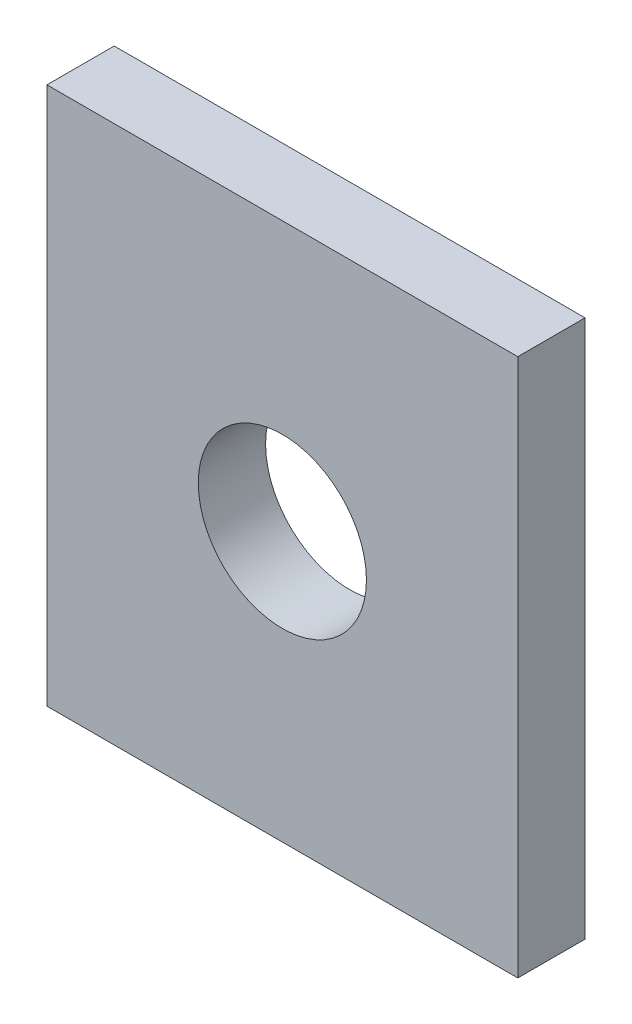
ISO-10303-21;
HEADER;
FILE_DESCRIPTION(('STEP AP214'),'2;1');
FILE_NAME('part.step','',(''),(''),'','','');
FILE_SCHEMA(('AUTOMOTIVE_DESIGN { 1 0 10303 214 1 1 1 1 }'));
ENDSEC;
DATA;
#1=APPLICATION_CONTEXT('core data for automotive mechanical design processes');
#2=APPLICATION_PROTOCOL_DEFINITION('international standard','automotive_design',2000,#1);
#3=PRODUCT_CONTEXT('',#1,'mechanical');
#4=PRODUCT('Part','Part','',(#3));
#5=PRODUCT_RELATED_PRODUCT_CATEGORY('part','',(#4));
#6=PRODUCT_DEFINITION_FORMATION('','',#4);
#7=PRODUCT_DEFINITION_CONTEXT('part definition',#1,'design');
#8=PRODUCT_DEFINITION('design','',#6,#7);
#9=PRODUCT_DEFINITION_SHAPE('','',#8);
#10=(LENGTH_UNIT() NAMED_UNIT(*) SI_UNIT(.MILLI.,.METRE.));
#11=(NAMED_UNIT(*) PLANE_ANGLE_UNIT() SI_UNIT($,.RADIAN.));
#12=(NAMED_UNIT(*) SI_UNIT($,.STERADIAN.) SOLID_ANGLE_UNIT());
#13=UNCERTAINTY_MEASURE_WITH_UNIT(LENGTH_MEASURE(1.E-05),#10,'distance_accuracy_value','');
#14=(GEOMETRIC_REPRESENTATION_CONTEXT(3) GLOBAL_UNCERTAINTY_ASSIGNED_CONTEXT((#13)) GLOBAL_UNIT_ASSIGNED_CONTEXT((#10,
#11,#12)) REPRESENTATION_CONTEXT('',''));
#15=CARTESIAN_POINT('',(0.,0.,0.));
#16=DIRECTION('',(0.,0.,1.));
#17=DIRECTION('',(1.,0.,0.));
#18=AXIS2_PLACEMENT_3D('',#15,#16,#17);
#19=CARTESIAN_POINT('',(17.5,-20.,2.5));
#20=DIRECTION('',(-1.,0.,0.));
#21=DIRECTION('',(0.,0.,1.));
#22=AXIS2_PLACEMENT_3D('',#19,#20,#21);
#23=PLANE('',#22);
#24=DIRECTION('',(0.,1.,0.));
#25=VECTOR('',#24,1.);
#26=CARTESIAN_POINT('',(17.5,-20.,-2.5));
#27=LINE('',#26,#25);
#28=CARTESIAN_POINT('',(17.5,-20.,-2.5));
#29=VERTEX_POINT('',#28);
#30=CARTESIAN_POINT('',(17.5,20.,-2.5));
#31=VERTEX_POINT('',#30);
#32=EDGE_CURVE('E102',#29,#31,#27,.T.);
#33=ORIENTED_EDGE('',*,*,#32,.T.);
#34=DIRECTION('',(0.,0.,-1.));
#35=VECTOR('',#34,1.);
#36=CARTESIAN_POINT('',(17.5,20.,2.5));
#37=LINE('',#36,#35);
#38=CARTESIAN_POINT('',(17.5,20.,2.5));
#39=VERTEX_POINT('',#38);
#40=EDGE_CURVE('E11',#39,#31,#37,.T.);
#41=ORIENTED_EDGE('',*,*,#40,.F.);
#42=DIRECTION('',(0.,1.,0.));
#43=VECTOR('',#42,1.);
#44=CARTESIAN_POINT('',(17.5,-20.,2.5));
#45=LINE('',#44,#43);
#46=CARTESIAN_POINT('',(17.5,-20.,2.5));
#47=VERTEX_POINT('',#46);
#48=EDGE_CURVE('E90',#47,#39,#45,.T.);
#49=ORIENTED_EDGE('',*,*,#48,.F.);
#50=DIRECTION('',(0.,0.,-1.));
#51=VECTOR('',#50,1.);
#52=CARTESIAN_POINT('',(17.5,-20.,2.5));
#53=LINE('',#52,#51);
#54=EDGE_CURVE('E98',#47,#29,#53,.T.);
#55=ORIENTED_EDGE('',*,*,#54,.T.);
#56=EDGE_LOOP('',(#33,#41,#49,#55));
#57=FACE_BOUND('',#56,.T.);
#58=ADVANCED_FACE('F39',(#57),#23,.F.);
#59=CARTESIAN_POINT('',(-17.5,20.,2.5));
#60=DIRECTION('',(0.,-1.,0.));
#61=DIRECTION('',(0.,0.,-1.));
#62=AXIS2_PLACEMENT_3D('',#59,#60,#61);
#63=PLANE('',#62);
#64=DIRECTION('',(-1.,0.,0.));
#65=VECTOR('',#64,1.);
#66=CARTESIAN_POINT('',(-17.5,20.,-2.5));
#67=LINE('',#66,#65);
#68=CARTESIAN_POINT('',(-17.5,20.,-2.5));
#69=VERTEX_POINT('',#68);
#70=EDGE_CURVE('E94',#31,#69,#67,.T.);
#71=ORIENTED_EDGE('',*,*,#70,.T.);
#72=DIRECTION('',(0.,0.,-1.));
#73=VECTOR('',#72,1.);
#74=CARTESIAN_POINT('',(-17.5,20.,2.5));
#75=LINE('',#74,#73);
#76=CARTESIAN_POINT('',(-17.5,20.,2.5));
#77=VERTEX_POINT('',#76);
#78=EDGE_CURVE('E47',#77,#69,#75,.T.);
#79=ORIENTED_EDGE('',*,*,#78,.F.);
#80=DIRECTION('',(-1.,0.,0.));
#81=VECTOR('',#80,1.);
#82=CARTESIAN_POINT('',(-17.5,20.,2.5));
#83=LINE('',#82,#81);
#84=EDGE_CURVE('E85',#39,#77,#83,.T.);
#85=ORIENTED_EDGE('',*,*,#84,.F.);
#86=ORIENTED_EDGE('',*,*,#40,.T.);
#87=EDGE_LOOP('',(#71,#79,#85,#86));
#88=FACE_BOUND('',#87,.T.);
#89=ADVANCED_FACE('F93',(#88),#63,.F.);
#90=CARTESIAN_POINT('',(-17.5,-20.,2.5));
#91=DIRECTION('',(1.,0.,0.));
#92=DIRECTION('',(0.,0.,-1.));
#93=AXIS2_PLACEMENT_3D('',#90,#91,#92);
#94=PLANE('',#93);
#95=DIRECTION('',(0.,-1.,0.));
#96=VECTOR('',#95,1.);
#97=CARTESIAN_POINT('',(-17.5,-20.,-2.5));
#98=LINE('',#97,#96);
#99=CARTESIAN_POINT('',(-17.5,-20.,-2.5));
#100=VERTEX_POINT('',#99);
#101=EDGE_CURVE('E72',#69,#100,#98,.T.);
#102=ORIENTED_EDGE('',*,*,#101,.T.);
#103=DIRECTION('',(0.,0.,-1.));
#104=VECTOR('',#103,1.);
#105=CARTESIAN_POINT('',(-17.5,-20.,2.5));
#106=LINE('',#105,#104);
#107=CARTESIAN_POINT('',(-17.5,-20.,2.5));
#108=VERTEX_POINT('',#107);
#109=EDGE_CURVE('E95',#108,#100,#106,.T.);
#110=ORIENTED_EDGE('',*,*,#109,.F.);
#111=DIRECTION('',(0.,-1.,0.));
#112=VECTOR('',#111,1.);
#113=CARTESIAN_POINT('',(-17.5,-20.,2.5));
#114=LINE('',#113,#112);
#115=EDGE_CURVE('E88',#77,#108,#114,.T.);
#116=ORIENTED_EDGE('',*,*,#115,.F.);
#117=ORIENTED_EDGE('',*,*,#78,.T.);
#118=EDGE_LOOP('',(#102,#110,#116,#117));
#119=FACE_BOUND('',#118,.T.);
#120=ADVANCED_FACE('F96',(#119),#94,.F.);
#121=CARTESIAN_POINT('',(-17.5,-20.,2.5));
#122=DIRECTION('',(0.,1.,0.));
#123=DIRECTION('',(0.,0.,1.));
#124=AXIS2_PLACEMENT_3D('',#121,#122,#123);
#125=PLANE('',#124);
#126=DIRECTION('',(1.,0.,0.));
#127=VECTOR('',#126,1.);
#128=CARTESIAN_POINT('',(-17.5,-20.,-2.5));
#129=LINE('',#128,#127);
#130=EDGE_CURVE('E78',#100,#29,#129,.T.);
#131=ORIENTED_EDGE('',*,*,#130,.T.);
#132=ORIENTED_EDGE('',*,*,#54,.F.);
#133=DIRECTION('',(1.,0.,0.));
#134=VECTOR('',#133,1.);
#135=CARTESIAN_POINT('',(-17.5,-20.,2.5));
#136=LINE('',#135,#134);
#137=EDGE_CURVE('E55',#108,#47,#136,.T.);
#138=ORIENTED_EDGE('',*,*,#137,.F.);
#139=ORIENTED_EDGE('',*,*,#109,.T.);
#140=EDGE_LOOP('',(#131,#132,#138,#139));
#141=FACE_BOUND('',#140,.T.);
#142=ADVANCED_FACE('F110',(#141),#125,.F.);
#143=CARTESIAN_POINT('',(0.,0.,2.5));
#144=DIRECTION('',(0.,0.,-1.));
#145=DIRECTION('',(-1.,0.,0.));
#146=AXIS2_PLACEMENT_3D('',#143,#144,#145);
#147=PLANE('',#146);
#148=CARTESIAN_POINT('',(0.,0.,2.5));
#149=DIRECTION('',(0.,0.,1.));
#150=DIRECTION('',(1.,0.,0.));
#151=AXIS2_PLACEMENT_3D('',#148,#149,#150);
#152=CIRCLE('',#151,6.25);
#153=CARTESIAN_POINT('',(6.25,0.,2.5));
#154=VERTEX_POINT('',#153);
#155=EDGE_CURVE('E116',#154,#154,#152,.T.);
#156=ORIENTED_EDGE('',*,*,#155,.F.);
#157=EDGE_LOOP('',(#156));
#158=FACE_BOUND('',#157,.T.);
#159=ORIENTED_EDGE('',*,*,#48,.T.);
#160=ORIENTED_EDGE('',*,*,#84,.T.);
#161=ORIENTED_EDGE('',*,*,#115,.T.);
#162=ORIENTED_EDGE('',*,*,#137,.T.);
#163=EDGE_LOOP('',(#159,#160,#161,#162));
#164=FACE_BOUND('',#163,.T.);
#165=ADVANCED_FACE('F86',(#158,#164),#147,.F.);
#166=CARTESIAN_POINT('',(0.,0.,-2.5));
#167=DIRECTION('',(0.,0.,-1.));
#168=DIRECTION('',(-1.,0.,0.));
#169=AXIS2_PLACEMENT_3D('',#166,#167,#168);
#170=PLANE('',#169);
#171=CARTESIAN_POINT('',(0.,0.,-2.5));
#172=DIRECTION('',(0.,0.,1.));
#173=DIRECTION('',(1.,0.,0.));
#174=AXIS2_PLACEMENT_3D('',#171,#172,#173);
#175=CIRCLE('',#174,6.25);
#176=CARTESIAN_POINT('',(6.25,0.,-2.5));
#177=VERTEX_POINT('',#176);
#178=EDGE_CURVE('E105',#177,#177,#175,.T.);
#179=ORIENTED_EDGE('',*,*,#178,.T.);
#180=EDGE_LOOP('',(#179));
#181=FACE_BOUND('',#180,.T.);
#182=ORIENTED_EDGE('',*,*,#32,.F.);
#183=ORIENTED_EDGE('',*,*,#130,.F.);
#184=ORIENTED_EDGE('',*,*,#101,.F.);
#185=ORIENTED_EDGE('',*,*,#70,.F.);
#186=EDGE_LOOP('',(#182,#183,#184,#185));
#187=FACE_BOUND('',#186,.T.);
#188=ADVANCED_FACE('F113',(#181,#187),#170,.T.);
#189=CARTESIAN_POINT('',(0.,0.,-2.5));
#190=DIRECTION('',(0.,0.,1.));
#191=DIRECTION('',(1.,0.,0.));
#192=AXIS2_PLACEMENT_3D('',#189,#190,#191);
#193=CYLINDRICAL_SURFACE('',#192,6.25);
#194=ORIENTED_EDGE('',*,*,#178,.F.);
#195=EDGE_LOOP('',(#194));
#196=FACE_BOUND('',#195,.T.);
#197=ORIENTED_EDGE('',*,*,#155,.T.);
#198=EDGE_LOOP('',(#197));
#199=FACE_BOUND('',#198,.T.);
#200=ADVANCED_FACE('F123',(#196,#199),#193,.F.);
#201=CLOSED_SHELL('',(#58,#89,#120,#142,#165,#188,#200));
#202=MANIFOLD_SOLID_BREP('B2',#201);
#203=ADVANCED_BREP_SHAPE_REPRESENTATION('',(#18,#202),#14);
#204=SHAPE_DEFINITION_REPRESENTATION(#9,#203);
ENDSEC;
END-ISO-10303-21;
